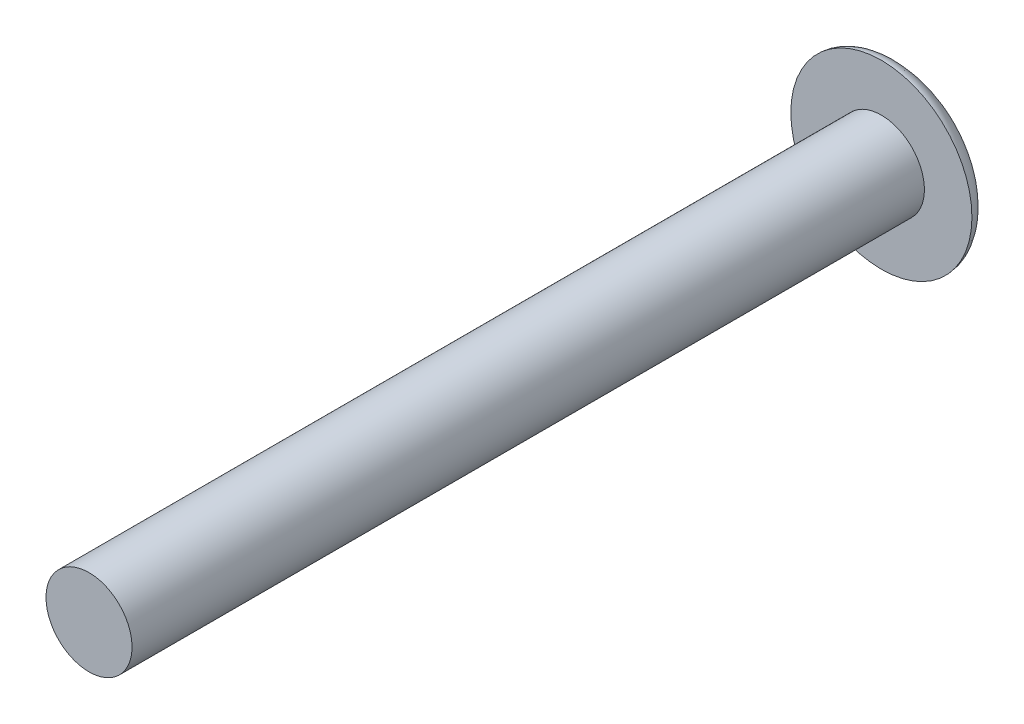
ISO-10303-21;
HEADER;
FILE_DESCRIPTION(('STEP AP214'),'2;1');
FILE_NAME('part.step','',(''),(''),'','','');
FILE_SCHEMA(('AUTOMOTIVE_DESIGN { 1 0 10303 214 1 1 1 1 }'));
ENDSEC;
DATA;
#1=APPLICATION_CONTEXT('core data for automotive mechanical design processes');
#2=APPLICATION_PROTOCOL_DEFINITION('international standard','automotive_design',2000,#1);
#3=PRODUCT_CONTEXT('',#1,'mechanical');
#4=PRODUCT('Part','Part','',(#3));
#5=PRODUCT_RELATED_PRODUCT_CATEGORY('part','',(#4));
#6=PRODUCT_DEFINITION_FORMATION('','',#4);
#7=PRODUCT_DEFINITION_CONTEXT('part definition',#1,'design');
#8=PRODUCT_DEFINITION('design','',#6,#7);
#9=PRODUCT_DEFINITION_SHAPE('','',#8);
#10=(LENGTH_UNIT() NAMED_UNIT(*) SI_UNIT(.MILLI.,.METRE.));
#11=(NAMED_UNIT(*) PLANE_ANGLE_UNIT() SI_UNIT($,.RADIAN.));
#12=(NAMED_UNIT(*) SI_UNIT($,.STERADIAN.) SOLID_ANGLE_UNIT());
#13=UNCERTAINTY_MEASURE_WITH_UNIT(LENGTH_MEASURE(1.E-05),#10,'distance_accuracy_value','');
#14=(GEOMETRIC_REPRESENTATION_CONTEXT(3) GLOBAL_UNCERTAINTY_ASSIGNED_CONTEXT((#13)) GLOBAL_UNIT_ASSIGNED_CONTEXT((#10,
#11,#12)) REPRESENTATION_CONTEXT('',''));
#15=CARTESIAN_POINT('',(0.,0.,0.));
#16=DIRECTION('',(0.,0.,1.));
#17=DIRECTION('',(1.,0.,0.));
#18=AXIS2_PLACEMENT_3D('',#15,#16,#17);
#19=CARTESIAN_POINT('',(0.,0.,0.));
#20=DIRECTION('',(0.,1.,0.));
#21=DIRECTION('',(1.,0.,0.));
#22=AXIS2_PLACEMENT_3D('',#19,#20,#21);
#23=ELLIPSE('',#22,4.,1.5);
#24=TRIMMED_CURVE('',#23,(PARAMETER_VALUE(-1.5707963267949)),(PARAMETER_VALUE(1.5707963267949)),
.T.,.PARAMETER.);
#25=CARTESIAN_POINT('',(0.,0.,0.));
#26=DIRECTION('',(0.,0.,-1.));
#27=AXIS1_PLACEMENT('',#25,#26);
#28=SURFACE_OF_REVOLUTION('',#24,#27);
#29=CARTESIAN_POINT('',(0.,0.,0.));
#30=DIRECTION('',(0.,0.,-1.));
#31=DIRECTION('',(-1.,0.,0.));
#32=AXIS2_PLACEMENT_3D('',#29,#30,#31);
#33=CIRCLE('',#32,4.);
#34=CARTESIAN_POINT('',(-4.,0.,0.));
#35=VERTEX_POINT('',#34);
#36=EDGE_CURVE('E76',#35,#35,#33,.T.);
#37=ORIENTED_EDGE('',*,*,#36,.T.);
#38=EDGE_LOOP('',(#37));
#39=FACE_BOUND('',#38,.T.);
#40=CARTESIAN_POINT('',(0.,0.,-0.5));
#41=DIRECTION('',(0.,0.,-1.));
#42=DIRECTION('',(-1.,0.,0.));
#43=AXIS2_PLACEMENT_3D('',#40,#41,#42);
#44=CIRCLE('',#43,3.77123616632825);
#45=CARTESIAN_POINT('',(-3.73794358200097,-0.5,-0.5));
#46=VERTEX_POINT('',#45);
#47=CARTESIAN_POINT('',(-3.73794358200097,0.5,-0.5));
#48=VERTEX_POINT('',#47);
#49=EDGE_CURVE('E11',#46,#48,#44,.T.);
#50=ORIENTED_EDGE('',*,*,#49,.F.);
#51=CARTESIAN_POINT('',(-3.73794358200098,-0.5,-0.499999999999997));
#52=CARTESIAN_POINT('',(-3.70788436804743,-0.5,-0.531539594869838));
#53=CARTESIAN_POINT('',(-3.67625775615341,-0.5,-0.561485152560765));
#54=CARTESIAN_POINT('',(-3.61063583024477,-0.500000000000001,-0.618495196540235));
#55=CARTESIAN_POINT('',(-3.57664681061348,-0.500000000000001,-0.645566887162769));
#56=CARTESIAN_POINT('',(-3.50723260338958,-0.5,-0.697051137306731));
#57=CARTESIAN_POINT('',(-3.47182392594061,-0.5,-0.721486307749546));
#58=CARTESIAN_POINT('',(-3.39964204032496,-0.500000000000001,-0.768304990954348));
#59=CARTESIAN_POINT('',(-3.36286773540544,-0.500000000000001,-0.790686802290618));
#60=CARTESIAN_POINT('',(-3.25590688820595,-0.500000000000002,-0.852283551290862));
#61=CARTESIAN_POINT('',(-3.18442371705617,-0.500000000000001,-0.889247698747954));
#62=CARTESIAN_POINT('',(-3.03901788049557,-0.5,-0.958127852982823));
#63=CARTESIAN_POINT('',(-2.96509255344054,-0.5,-0.990038116513606));
#64=CARTESIAN_POINT('',(-2.81552324510241,-0.5,-1.04964755503891));
#65=CARTESIAN_POINT('',(-2.73987823904761,-0.5,-1.0773441392154));
#66=CARTESIAN_POINT('',(-2.58650721664517,-0.5,-1.12941597311597));
#67=CARTESIAN_POINT('',(-2.50876732742966,-0.5,-1.15374997748891));
#68=CARTESIAN_POINT('',(-2.35241909823695,-0.5,-1.19917306805137));
#69=CARTESIAN_POINT('',(-2.2738115086932,-0.5,-1.22026475370611));
#70=CARTESIAN_POINT('',(-2.11589949808419,-0.5,-1.25957248742194));
#71=CARTESIAN_POINT('',(-2.03659518926247,-0.5,-1.27778899002999));
#72=CARTESIAN_POINT('',(-1.83297523621598,-0.5,-1.32107350384167));
#73=CARTESIAN_POINT('',(-1.70826313818278,-0.5,-1.34428421605878));
#74=CARTESIAN_POINT('',(-1.45792127908993,-0.5,-1.38512015479272));
#75=CARTESIAN_POINT('',(-1.33229136353913,-0.5,-1.40274441772869));
#76=CARTESIAN_POINT('',(-1.08092851709944,-0.5,-1.43282026079474));
#77=CARTESIAN_POINT('',(-0.955198021005348,-0.5,-1.44529230705698));
#78=CARTESIAN_POINT('',(-0.70335324570923,-0.5,-1.46547130959931));
#79=CARTESIAN_POINT('',(-0.57723894346515,-0.5,-1.47317797388));
#80=CARTESIAN_POINT('',(-0.280569525247778,-0.5,-1.48590618735221));
#81=CARTESIAN_POINT('',(-0.109930690251786,-0.5,-1.48903990932992));
#82=CARTESIAN_POINT('',(0.23137866356758,-0.5,-1.48708186841007));
#83=CARTESIAN_POINT('',(0.402049157167057,-0.500000000000001,-1.48198608774184));
#84=CARTESIAN_POINT('',(0.743135166656457,-0.499999999999999,-1.46334118724829));
#85=CARTESIAN_POINT('',(0.913550160901465,-0.499999999999997,-1.44978231754656));
#86=CARTESIAN_POINT('',(1.25371386852199,-0.500000000000003,-1.41358190981026));
#87=CARTESIAN_POINT('',(1.42346095925263,-0.50000000000001,-1.39092498879713));
#88=CARTESIAN_POINT('',(1.76118290824477,-0.49999999999999,-1.33545765813648));
#89=CARTESIAN_POINT('',(1.92915926148295,-0.499999999999964,-1.30265666615522));
#90=CARTESIAN_POINT('',(2.17886686194349,-0.500000000000018,-1.2444160743912));
#91=CARTESIAN_POINT('',(2.26166549899031,-0.500000000000052,-1.22351502577257));
#92=CARTESIAN_POINT('',(2.42632687671089,-0.499999999999948,-1.17832199022203));
#93=CARTESIAN_POINT('',(2.5081897839709,-0.499999999999811,-1.15403061736545));
#94=CARTESIAN_POINT('',(2.66095512459973,-0.49999999999983,-1.10470575710333));
#95=CARTESIAN_POINT('',(2.73199774052766,-0.499999999999954,-1.0801082738164));
#96=CARTESIAN_POINT('',(2.87281584643164,-0.500000000000045,-1.02744726350779));
#97=CARTESIAN_POINT('',(2.94259105253518,-0.500000000000012,-0.999382970712934));
#98=CARTESIAN_POINT('',(3.07980811153932,-0.499999999999988,-0.939432632592069));
#99=CARTESIAN_POINT('',(3.1472645564148,-0.499999999999997,-0.907580357975692));
#100=CARTESIAN_POINT('',(3.27967390285928,-0.500000000000003,-0.839068926080142));
#101=CARTESIAN_POINT('',(3.34462814677331,-0.500000000000001,-0.802412393928927));
#102=CARTESIAN_POINT('',(3.4671797481675,-0.499999999999999,-0.725422550020235));
#103=CARTESIAN_POINT('',(3.52498521500755,-0.499999999999999,-0.685429066505216));
#104=CARTESIAN_POINT('',(3.60805580706899,-0.5,-0.620291733515205));
#105=CARTESIAN_POINT('',(3.63524804056089,-0.5,-0.597613324910002));
#106=CARTESIAN_POINT('',(3.68796349587972,-0.499999999999999,-0.550313842841018));
#107=CARTESIAN_POINT('',(3.71348379294128,-0.499999999999999,-0.52568952300532));
#108=CARTESIAN_POINT('',(3.73794358200099,-0.499999999999998,-0.499999999999971));
#109=B_SPLINE_CURVE_WITH_KNOTS('',3,(#51,#52,#53,#54,#55,#56,#57,#58,#59,#60,#61,#62,#63,#64,
#65,#66,#67,#68,#69,#70,#71,#72,#73,#74,#75,#76,#77,#78,#79,#80,#81,#82,#83,#84,#85,#86,#87,#88,
#89,#90,#91,#92,#93,#94,#95,#96,#97,#98,#99,#100,#101,#102,#103,#104,#105,#106,#107,#108),
.UNSPECIFIED.,.F.,.F.,(4,2,2,2,2,2,2,2,2,2,2,2,2,2,2,2,2,2,2,2,2,2,2,2,2,2,2,2,4),(0.,
0.130546745175973,0.260758092064875,0.389745019669768,0.51883787911506,0.759977185286991,
1.00138858643088,1.24294782677998,1.48724755740954,1.7313503924082,1.97541459766486,
2.35582001437147,2.73629100979355,3.11523578158189,3.49420377096001,4.00599670151702,
4.51803957285575,5.03067343320995,5.54417772888154,6.05720671559869,6.31333842749354,
6.56942380737738,6.79488999300472,7.02040607053468,7.2440442216206,7.46756067855978,
7.67802138690034,7.78416295068031,7.89048548895804),.UNSPECIFIED.);
#110=CARTESIAN_POINT('',(3.73794358200097,-0.5,-0.5));
#111=VERTEX_POINT('',#110);
#112=EDGE_CURVE('E66',#46,#111,#109,.T.);
#113=ORIENTED_EDGE('',*,*,#112,.T.);
#114=CARTESIAN_POINT('',(3.73794358200097,0.5,-0.5));
#115=VERTEX_POINT('',#114);
#116=EDGE_CURVE('E48',#115,#111,#44,.T.);
#117=ORIENTED_EDGE('',*,*,#116,.F.);
#118=CARTESIAN_POINT('',(3.73794358200102,0.499999999999996,-0.499999999999981));
#119=CARTESIAN_POINT('',(3.70787952381337,0.499999999999999,-0.531544649803601));
#120=CARTESIAN_POINT('',(3.67624759242309,0.5,-0.561494758107787));
#121=CARTESIAN_POINT('',(3.61061438114374,0.500000000000001,-0.618513043828577));
#122=CARTESIAN_POINT('',(3.57661939808419,0.5,-0.645588428565865));
#123=CARTESIAN_POINT('',(3.50720404505202,0.5,-0.697071126325818));
#124=CARTESIAN_POINT('',(3.47180074563633,0.5,-0.721501819077315));
#125=CARTESIAN_POINT('',(3.39963011570119,0.5,-0.768312248952718));
#126=CARTESIAN_POINT('',(3.36286168940957,0.5,-0.790690286149602));
#127=CARTESIAN_POINT('',(3.2559245540142,0.5,-0.852273373991773));
#128=CARTESIAN_POINT('',(3.18445996508266,0.5,-0.889228934053416));
#129=CARTESIAN_POINT('',(3.039092289438,0.5,-0.958094194092505));
#130=CARTESIAN_POINT('',(2.96518654343112,0.5,-0.989998156222059));
#131=CARTESIAN_POINT('',(2.81565696412498,0.5,-1.04959676006433));
#132=CARTESIAN_POINT('',(2.74003210630279,0.5,-1.07728881180636));
#133=CARTESIAN_POINT('',(2.58666304156571,0.5,-1.12936618235619));
#134=CARTESIAN_POINT('',(2.50890433809071,0.5,-1.15370840710531));
#135=CARTESIAN_POINT('',(2.35251784245474,0.5,-1.19914614094929));
#136=CARTESIAN_POINT('',(2.27389080045892,0.5,-1.22024424838932));
#137=CARTESIAN_POINT('',(2.11593944851055,0.5,-1.25956330933248));
#138=CARTESIAN_POINT('',(2.03661525036163,0.499999999999999,-1.27778471559709));
#139=CARTESIAN_POINT('',(1.83288772740875,0.499999999999999,-1.32109212153419));
#140=CARTESIAN_POINT('',(1.70808709186885,0.5,-1.34431705892028));
#141=CARTESIAN_POINT('',(1.45756809509131,0.5,-1.3851736360931));
#142=CARTESIAN_POINT('',(1.33184958268295,0.5,-1.40280433225523));
#143=CARTESIAN_POINT('',(1.08048725150567,0.5,-1.43286601218911));
#144=CARTESIAN_POINT('',(0.954846741963865,0.5,-1.4453247416459));
#145=CARTESIAN_POINT('',(0.703183055120063,0.5,-1.46548065234934));
#146=CARTESIAN_POINT('',(0.577159837484745,0.5,-1.4731773128933));
#147=CARTESIAN_POINT('',(0.198619984540894,0.5,-1.48943023925183));
#148=CARTESIAN_POINT('',(-0.0542379193987726,0.5,-1.49113453225543));
#149=CARTESIAN_POINT('',(-0.433173564528773,0.5,-1.48010214044846));
#150=CARTESIAN_POINT('',(-0.559497961168852,0.5,-1.47415268496832));
#151=CARTESIAN_POINT('',(-0.811834668899741,0.5,-1.45755709052304));
#152=CARTESIAN_POINT('',(-0.93784701654019,0.499999999999999,-1.44691153058198));
#153=CARTESIAN_POINT('',(-1.18056291278587,0.500000000000001,-1.42159148897562));
#154=CARTESIAN_POINT('',(-1.29730131437193,0.500000000000002,-1.40725073254106));
#155=CARTESIAN_POINT('',(-1.53011214237509,0.499999999999998,-1.37396864448937));
#156=CARTESIAN_POINT('',(-1.64618465324555,0.499999999999991,-1.35502791009892));
#157=CARTESIAN_POINT('',(-1.87765105962939,0.500000000000008,-1.31202581826753));
#158=CARTESIAN_POINT('',(-1.9930428722825,0.500000000000031,-1.2879531683331));
#159=CARTESIAN_POINT('',(-2.22246548456602,0.499999999999968,-1.23402956948269));
#160=CARTESIAN_POINT('',(-2.33649657901225,0.499999999999882,-1.20417989727857));
#161=CARTESIAN_POINT('',(-2.52569894621355,0.499999999999915,-1.14851625454202));
#162=CARTESIAN_POINT('',(-2.60141689536656,0.499999999999977,-1.12456019074191));
#163=CARTESIAN_POINT('',(-2.75163485747359,0.500000000000022,-1.07310736659971));
#164=CARTESIAN_POINT('',(-2.82613513021387,0.500000000000006,-1.04561137289899));
#165=CARTESIAN_POINT('',(-2.97301864123323,0.499999999999994,-0.98666084448576));
#166=CARTESIAN_POINT('',(-3.04541227410619,0.499999999999998,-0.955232391793261));
#167=CARTESIAN_POINT('',(-3.18788650275292,0.500000000000001,-0.887463819887107));
#168=CARTESIAN_POINT('',(-3.2579677779098,0.499999999999999,-0.851125159597587));
#169=CARTESIAN_POINT('',(-3.36353996758619,0.499999999999999,-0.790284012536512));
#170=CARTESIAN_POINT('',(-3.40026240105746,0.5,-0.767918000556189));
#171=CARTESIAN_POINT('',(-3.47234257398151,0.499999999999999,-0.721134276299152));
#172=CARTESIAN_POINT('',(-3.50770138996373,0.499999999999999,-0.696718232929934));
#173=CARTESIAN_POINT('',(-3.57699119830672,0.5,-0.645296270507518));
#174=CARTESIAN_POINT('',(-3.61090702897389,0.500000000000002,-0.618269600546134));
#175=CARTESIAN_POINT('',(-3.6763875884679,0.499999999999997,-0.561362425133088));
#176=CARTESIAN_POINT('',(-3.70794625983053,0.499999999999991,-0.531474988818786));
#177=CARTESIAN_POINT('',(-3.73794358200084,0.499999999999975,-0.500000000000141));
#178=B_SPLINE_CURVE_WITH_KNOTS('',3,(#118,#119,#120,#121,#122,#123,#124,#125,#126,#127,#128,
#129,#130,#131,#132,#133,#134,#135,#136,#137,#138,#139,#140,#141,#142,#143,#144,#145,#146,#147,
#148,#149,#150,#151,#152,#153,#154,#155,#156,#157,#158,#159,#160,#161,#162,#163,#164,#165,#166,
#167,#168,#169,#170,#171,#172,#173,#174,#175,#176,#177),.UNSPECIFIED.,.F.,.F.,(4,2,2,2,2,2,2,2,
2,2,2,2,2,2,2,2,2,2,2,2,2,2,2,2,2,2,2,2,2,4),(0.,0.130567673117723,0.260799855481819,
0.389765931061672,0.518837864671633,0.759916025856237,1.00126608072039,1.24276395073069,
1.48712483102634,1.73128896169753,1.97541462519574,2.35608831453844,2.73682618100903,
3.11549427757946,3.4942037718423,4.2520112601674,4.63134254418527,5.01062707017613,
5.36339346965187,5.71611409304167,6.069619020868,6.42304591374655,6.66122719544357,
6.89935698080402,7.13598367813942,7.37254022275907,7.50147554452892,7.6303069007489,
7.7602630804073,7.890542486809),.UNSPECIFIED.);
#179=EDGE_CURVE('E38',#115,#48,#178,.T.);
#180=ORIENTED_EDGE('',*,*,#179,.T.);
#181=EDGE_LOOP('',(#50,#113,#117,#180));
#182=FACE_BOUND('',#181,.T.);
#183=ADVANCED_FACE('F33',(#39,#182),#28,.T.);
#184=CARTESIAN_POINT('',(0.,0.,35.));
#185=DIRECTION('',(0.,0.,-1.));
#186=DIRECTION('',(-1.,0.,0.));
#187=AXIS2_PLACEMENT_3D('',#184,#185,#186);
#188=PLANE('',#187);
#189=CARTESIAN_POINT('',(0.,0.,35.));
#190=DIRECTION('',(0.,0.,-1.));
#191=DIRECTION('',(-1.,0.,0.));
#192=AXIS2_PLACEMENT_3D('',#189,#190,#191);
#193=CIRCLE('',#192,1.9);
#194=CARTESIAN_POINT('',(-1.9,0.,35.));
#195=VERTEX_POINT('',#194);
#196=EDGE_CURVE('E85',#195,#195,#193,.T.);
#197=ORIENTED_EDGE('',*,*,#196,.F.);
#198=EDGE_LOOP('',(#197));
#199=FACE_BOUND('',#198,.T.);
#200=ADVANCED_FACE('F102',(#199),#188,.F.);
#201=CARTESIAN_POINT('',(0.,0.,0.));
#202=DIRECTION('',(0.,0.,-1.));
#203=DIRECTION('',(-1.,0.,0.));
#204=AXIS2_PLACEMENT_3D('',#201,#202,#203);
#205=CYLINDRICAL_SURFACE('',#204,1.9);
#206=CARTESIAN_POINT('',(0.,0.,0.));
#207=DIRECTION('',(0.,0.,-1.));
#208=DIRECTION('',(-1.,0.,0.));
#209=AXIS2_PLACEMENT_3D('',#206,#207,#208);
#210=CIRCLE('',#209,1.9);
#211=CARTESIAN_POINT('',(-1.9,0.,0.));
#212=VERTEX_POINT('',#211);
#213=EDGE_CURVE('E79',#212,#212,#210,.T.);
#214=ORIENTED_EDGE('',*,*,#213,.F.);
#215=EDGE_LOOP('',(#214));
#216=FACE_BOUND('',#215,.T.);
#217=ORIENTED_EDGE('',*,*,#196,.T.);
#218=EDGE_LOOP('',(#217));
#219=FACE_BOUND('',#218,.T.);
#220=ADVANCED_FACE('F99',(#216,#219),#205,.T.);
#221=CARTESIAN_POINT('',(1.9,0.,0.));
#222=DIRECTION('',(0.,0.,-1.));
#223=DIRECTION('',(-1.,0.,0.));
#224=AXIS2_PLACEMENT_3D('',#221,#222,#223);
#225=PLANE('',#224);
#226=ORIENTED_EDGE('',*,*,#36,.F.);
#227=EDGE_LOOP('',(#226));
#228=FACE_BOUND('',#227,.T.);
#229=ORIENTED_EDGE('',*,*,#213,.T.);
#230=EDGE_LOOP('',(#229));
#231=FACE_BOUND('',#230,.T.);
#232=ADVANCED_FACE('F96',(#228,#231),#225,.F.);
#233=CARTESIAN_POINT('',(4.59999999999999,0.5,-10.5));
#234=DIRECTION('',(0.,1.,0.));
#235=DIRECTION('',(-1.,0.,0.));
#236=AXIS2_PLACEMENT_3D('',#233,#234,#235);
#237=PLANE('',#236);
#238=DIRECTION('',(-1.,0.,0.));
#239=VECTOR('',#238,1.);
#240=CARTESIAN_POINT('',(4.59999999999999,0.5,-0.5));
#241=LINE('',#240,#239);
#242=EDGE_CURVE('E54',#115,#48,#241,.T.);
#243=ORIENTED_EDGE('',*,*,#242,.T.);
#244=ORIENTED_EDGE('',*,*,#179,.F.);
#245=EDGE_LOOP('',(#243,#244));
#246=FACE_BOUND('',#245,.T.);
#247=ADVANCED_FACE('F75',(#246),#237,.F.);
#248=CARTESIAN_POINT('',(4.59999999999999,-0.5,-10.5));
#249=DIRECTION('',(0.,-1.,0.));
#250=DIRECTION('',(1.,0.,0.));
#251=AXIS2_PLACEMENT_3D('',#248,#249,#250);
#252=PLANE('',#251);
#253=DIRECTION('',(1.,0.,0.));
#254=VECTOR('',#253,1.);
#255=CARTESIAN_POINT('',(4.59999999999999,-0.5,-0.5));
#256=LINE('',#255,#254);
#257=EDGE_CURVE('E68',#46,#111,#256,.T.);
#258=ORIENTED_EDGE('',*,*,#257,.T.);
#259=ORIENTED_EDGE('',*,*,#112,.F.);
#260=EDGE_LOOP('',(#258,#259));
#261=FACE_BOUND('',#260,.T.);
#262=ADVANCED_FACE('F67',(#261),#252,.F.);
#263=CARTESIAN_POINT('',(0.,0.,-0.5));
#264=DIRECTION('',(0.,0.,-1.));
#265=DIRECTION('',(-1.,0.,0.));
#266=AXIS2_PLACEMENT_3D('',#263,#264,#265);
#267=PLANE('',#266);
#268=ORIENTED_EDGE('',*,*,#49,.T.);
#269=ORIENTED_EDGE('',*,*,#242,.F.);
#270=ORIENTED_EDGE('',*,*,#116,.T.);
#271=ORIENTED_EDGE('',*,*,#257,.F.);
#272=EDGE_LOOP('',(#268,#269,#270,#271));
#273=FACE_BOUND('',#272,.T.);
#274=ADVANCED_FACE('F71',(#273),#267,.T.);
#275=CLOSED_SHELL('',(#183,#200,#220,#232,#247,#262,#274));
#276=MANIFOLD_SOLID_BREP('B2',#275);
#277=ADVANCED_BREP_SHAPE_REPRESENTATION('',(#18,#276),#14);
#278=SHAPE_DEFINITION_REPRESENTATION(#9,#277);
ENDSEC;
END-ISO-10303-21;
